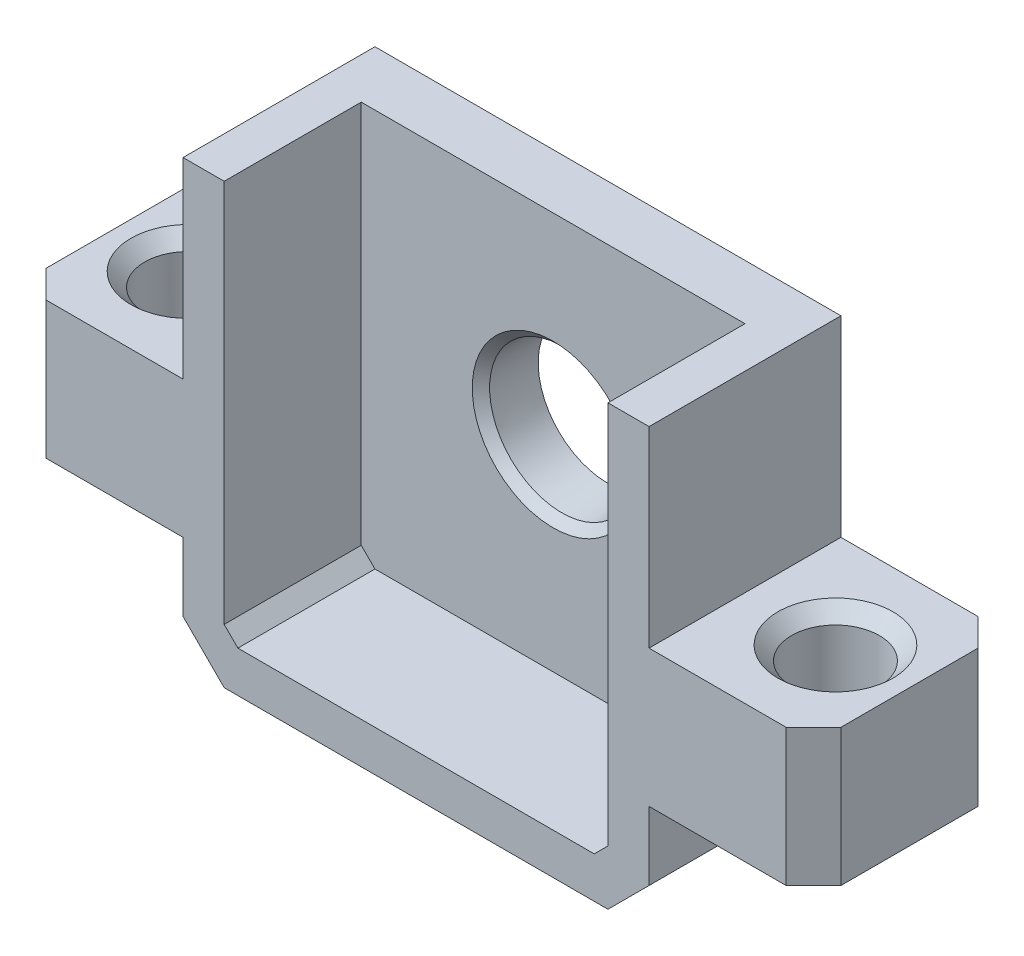
ISO-10303-21;
HEADER;
FILE_DESCRIPTION(('STEP AP214'),'2;1');
FILE_NAME('part.step','',(''),(''),'','','');
FILE_SCHEMA(('AUTOMOTIVE_DESIGN { 1 0 10303 214 1 1 1 1 }'));
ENDSEC;
DATA;
#1=APPLICATION_CONTEXT('core data for automotive mechanical design processes');
#2=APPLICATION_PROTOCOL_DEFINITION('international standard','automotive_design',2000,#1);
#3=PRODUCT_CONTEXT('',#1,'mechanical');
#4=PRODUCT('Part','Part','',(#3));
#5=PRODUCT_RELATED_PRODUCT_CATEGORY('part','',(#4));
#6=PRODUCT_DEFINITION_FORMATION('','',#4);
#7=PRODUCT_DEFINITION_CONTEXT('part definition',#1,'design');
#8=PRODUCT_DEFINITION('design','',#6,#7);
#9=PRODUCT_DEFINITION_SHAPE('','',#8);
#10=(LENGTH_UNIT() NAMED_UNIT(*) SI_UNIT(.MILLI.,.METRE.));
#11=(NAMED_UNIT(*) PLANE_ANGLE_UNIT() SI_UNIT($,.RADIAN.));
#12=(NAMED_UNIT(*) SI_UNIT($,.STERADIAN.) SOLID_ANGLE_UNIT());
#13=UNCERTAINTY_MEASURE_WITH_UNIT(LENGTH_MEASURE(1.E-05),#10,'distance_accuracy_value','');
#14=(GEOMETRIC_REPRESENTATION_CONTEXT(3) GLOBAL_UNCERTAINTY_ASSIGNED_CONTEXT((#13)) GLOBAL_UNIT_ASSIGNED_CONTEXT((#10,
#11,#12)) REPRESENTATION_CONTEXT('',''));
#15=CARTESIAN_POINT('',(0.,0.,0.));
#16=DIRECTION('',(0.,0.,1.));
#17=DIRECTION('',(1.,0.,0.));
#18=AXIS2_PLACEMENT_3D('',#15,#16,#17);
#19=CARTESIAN_POINT('',(-8.5,9.,2.));
#20=DIRECTION('',(1.,0.,0.));
#21=DIRECTION('',(0.,0.,-1.));
#22=AXIS2_PLACEMENT_3D('',#19,#20,#21);
#23=PLANE('',#22);
#24=DIRECTION('',(0.,0.,1.));
#25=VECTOR('',#24,1.);
#26=CARTESIAN_POINT('',(-8.5,7.,2.));
#27=LINE('',#26,#25);
#28=CARTESIAN_POINT('',(-8.5,7.,0.));
#29=VERTEX_POINT('',#28);
#30=CARTESIAN_POINT('',(-8.5,7.,7.));
#31=VERTEX_POINT('',#30);
#32=EDGE_CURVE('E501',#29,#31,#27,.T.);
#33=ORIENTED_EDGE('',*,*,#32,.F.);
#34=DIRECTION('',(0.,-1.,0.));
#35=VECTOR('',#34,1.);
#36=CARTESIAN_POINT('',(-8.5,9.,0.));
#37=LINE('',#36,#35);
#38=CARTESIAN_POINT('',(-8.5,0.,0.));
#39=VERTEX_POINT('',#38);
#40=EDGE_CURVE('E241',#29,#39,#37,.T.);
#41=ORIENTED_EDGE('',*,*,#40,.T.);
#42=DIRECTION('',(0.,0.,-1.));
#43=VECTOR('',#42,1.);
#44=CARTESIAN_POINT('',(-8.5,0.,0.));
#45=LINE('',#44,#43);
#46=CARTESIAN_POINT('',(-8.5,0.,7.));
#47=VERTEX_POINT('',#46);
#48=EDGE_CURVE('E434',#47,#39,#45,.T.);
#49=ORIENTED_EDGE('',*,*,#48,.F.);
#50=DIRECTION('',(0.,-1.,0.));
#51=VECTOR('',#50,1.);
#52=CARTESIAN_POINT('',(-8.5,9.,7.));
#53=LINE('',#52,#51);
#54=EDGE_CURVE('E231',#31,#47,#53,.T.);
#55=ORIENTED_EDGE('',*,*,#54,.F.);
#56=EDGE_LOOP('',(#33,#41,#49,#55));
#57=FACE_BOUND('',#56,.T.);
#58=ADVANCED_FACE('F35',(#57),#23,.F.);
#59=CARTESIAN_POINT('',(8.5,9.,2.));
#60=DIRECTION('',(-1.,0.,0.));
#61=DIRECTION('',(0.,0.,1.));
#62=AXIS2_PLACEMENT_3D('',#59,#60,#61);
#63=PLANE('',#62);
#64=DIRECTION('',(0.,0.,-1.));
#65=VECTOR('',#64,1.);
#66=CARTESIAN_POINT('',(8.5,7.,2.));
#67=LINE('',#66,#65);
#68=CARTESIAN_POINT('',(8.5,7.,7.));
#69=VERTEX_POINT('',#68);
#70=CARTESIAN_POINT('',(8.5,7.,0.));
#71=VERTEX_POINT('',#70);
#72=EDGE_CURVE('E525',#69,#71,#67,.T.);
#73=ORIENTED_EDGE('',*,*,#72,.F.);
#74=DIRECTION('',(0.,1.,0.));
#75=VECTOR('',#74,1.);
#76=CARTESIAN_POINT('',(8.5,9.,7.));
#77=LINE('',#76,#75);
#78=CARTESIAN_POINT('',(8.5,0.,7.));
#79=VERTEX_POINT('',#78);
#80=EDGE_CURVE('E237',#79,#69,#77,.T.);
#81=ORIENTED_EDGE('',*,*,#80,.F.);
#82=DIRECTION('',(0.,0.,-1.));
#83=VECTOR('',#82,1.);
#84=CARTESIAN_POINT('',(8.5,0.,0.));
#85=LINE('',#84,#83);
#86=CARTESIAN_POINT('',(8.5,0.,0.));
#87=VERTEX_POINT('',#86);
#88=EDGE_CURVE('E271',#79,#87,#85,.T.);
#89=ORIENTED_EDGE('',*,*,#88,.T.);
#90=DIRECTION('',(0.,1.,0.));
#91=VECTOR('',#90,1.);
#92=CARTESIAN_POINT('',(8.5,9.,0.));
#93=LINE('',#92,#91);
#94=EDGE_CURVE('E246',#87,#71,#93,.T.);
#95=ORIENTED_EDGE('',*,*,#94,.T.);
#96=EDGE_LOOP('',(#73,#81,#89,#95));
#97=FACE_BOUND('',#96,.T.);
#98=ADVANCED_FACE('F354',(#97),#63,.F.);
#99=CARTESIAN_POINT('',(0.,0.,0.));
#100=DIRECTION('',(0.,0.,1.));
#101=DIRECTION('',(1.,0.,0.));
#102=AXIS2_PLACEMENT_3D('',#99,#100,#101);
#103=PLANE('',#102);
#104=CARTESIAN_POINT('',(0.,0.,0.));
#105=DIRECTION('',(0.,0.,1.));
#106=DIRECTION('',(1.,0.,0.));
#107=AXIS2_PLACEMENT_3D('',#104,#105,#106);
#108=CIRCLE('',#107,2.54518444143392);
#109=CARTESIAN_POINT('',(2.54518444143392,0.,0.));
#110=VERTEX_POINT('',#109);
#111=EDGE_CURVE('E272',#110,#110,#108,.T.);
#112=ORIENTED_EDGE('',*,*,#111,.T.);
#113=EDGE_LOOP('',(#112));
#114=FACE_BOUND('',#113,.T.);
#115=DIRECTION('',(-1.,0.,0.));
#116=VECTOR('',#115,1.);
#117=CARTESIAN_POINT('',(0.,7.,0.));
#118=LINE('',#117,#116);
#119=EDGE_CURVE('E527',#71,#29,#118,.T.);
#120=ORIENTED_EDGE('',*,*,#119,.F.);
#121=ORIENTED_EDGE('',*,*,#94,.F.);
#122=DIRECTION('',(-1.,0.,0.));
#123=VECTOR('',#122,1.);
#124=CARTESIAN_POINT('',(14.5,0.,0.));
#125=LINE('',#124,#123);
#126=CARTESIAN_POINT('',(13.5,0.,0.));
#127=VERTEX_POINT('',#126);
#128=EDGE_CURVE('E425',#127,#87,#125,.T.);
#129=ORIENTED_EDGE('',*,*,#128,.F.);
#130=DIRECTION('',(0.,-1.,0.));
#131=VECTOR('',#130,1.);
#132=CARTESIAN_POINT('',(13.5,-5.,0.));
#133=LINE('',#132,#131);
#134=CARTESIAN_POINT('',(13.5,-5.,0.));
#135=VERTEX_POINT('',#134);
#136=EDGE_CURVE('E267',#127,#135,#133,.T.);
#137=ORIENTED_EDGE('',*,*,#136,.T.);
#138=DIRECTION('',(-1.,0.,0.));
#139=VECTOR('',#138,1.);
#140=CARTESIAN_POINT('',(14.5,-5.,0.));
#141=LINE('',#140,#139);
#142=CARTESIAN_POINT('',(8.5,-5.,0.));
#143=VERTEX_POINT('',#142);
#144=EDGE_CURVE('E419',#135,#143,#141,.T.);
#145=ORIENTED_EDGE('',*,*,#144,.T.);
#146=CARTESIAN_POINT('',(8.5,-7.5,0.));
#147=VERTEX_POINT('',#146);
#148=EDGE_CURVE('E247',#147,#143,#93,.T.);
#149=ORIENTED_EDGE('',*,*,#148,.F.);
#150=DIRECTION('',(0.707106781186549,0.707106781186546,0.));
#151=VECTOR('',#150,1.);
#152=CARTESIAN_POINT('',(8.5,-7.5,0.));
#153=LINE('',#152,#151);
#154=CARTESIAN_POINT('',(6.99999999999999,-9.,0.));
#155=VERTEX_POINT('',#154);
#156=EDGE_CURVE('E292',#147,#155,#153,.F.);
#157=ORIENTED_EDGE('',*,*,#156,.T.);
#158=DIRECTION('',(1.,0.,0.));
#159=VECTOR('',#158,1.);
#160=CARTESIAN_POINT('',(-8.5,-9.,0.));
#161=LINE('',#160,#159);
#162=CARTESIAN_POINT('',(-7.00000000000001,-9.,0.));
#163=VERTEX_POINT('',#162);
#164=EDGE_CURVE('E243',#163,#155,#161,.T.);
#165=ORIENTED_EDGE('',*,*,#164,.F.);
#166=DIRECTION('',(0.707106781186545,-0.70710678118655,0.));
#167=VECTOR('',#166,1.);
#168=CARTESIAN_POINT('',(-7.00000000000001,-9.,0.));
#169=LINE('',#168,#167);
#170=CARTESIAN_POINT('',(-8.5,-7.49999999999999,0.));
#171=VERTEX_POINT('',#170);
#172=EDGE_CURVE('E290',#163,#171,#169,.F.);
#173=ORIENTED_EDGE('',*,*,#172,.T.);
#174=CARTESIAN_POINT('',(-8.5,-5.,0.));
#175=VERTEX_POINT('',#174);
#176=EDGE_CURVE('E240',#175,#171,#37,.T.);
#177=ORIENTED_EDGE('',*,*,#176,.F.);
#178=DIRECTION('',(1.,0.,0.));
#179=VECTOR('',#178,1.);
#180=CARTESIAN_POINT('',(-14.5,-5.,0.));
#181=LINE('',#180,#179);
#182=CARTESIAN_POINT('',(-13.5,-5.,0.));
#183=VERTEX_POINT('',#182);
#184=EDGE_CURVE('E219',#183,#175,#181,.T.);
#185=ORIENTED_EDGE('',*,*,#184,.F.);
#186=DIRECTION('',(0.,1.,0.));
#187=VECTOR('',#186,1.);
#188=CARTESIAN_POINT('',(-13.5,0.,0.));
#189=LINE('',#188,#187);
#190=CARTESIAN_POINT('',(-13.5,0.,0.));
#191=VERTEX_POINT('',#190);
#192=EDGE_CURVE('E259',#183,#191,#189,.T.);
#193=ORIENTED_EDGE('',*,*,#192,.T.);
#194=DIRECTION('',(1.,0.,0.));
#195=VECTOR('',#194,1.);
#196=CARTESIAN_POINT('',(-14.5,0.,0.));
#197=LINE('',#196,#195);
#198=EDGE_CURVE('E437',#191,#39,#197,.T.);
#199=ORIENTED_EDGE('',*,*,#198,.T.);
#200=ORIENTED_EDGE('',*,*,#40,.F.);
#201=EDGE_LOOP('',(#120,#121,#129,#137,#145,#149,#157,#165,#173,#177,#185,#193,#199,#200));
#202=FACE_BOUND('',#201,.T.);
#203=ADVANCED_FACE('F361',(#114,#202),#103,.F.);
#204=CARTESIAN_POINT('',(0.,0.,7.));
#205=DIRECTION('',(0.,0.,1.));
#206=DIRECTION('',(1.,0.,0.));
#207=AXIS2_PLACEMENT_3D('',#204,#205,#206);
#208=PLANE('',#207);
#209=ORIENTED_EDGE('',*,*,#80,.T.);
#210=DIRECTION('',(-1.,0.,0.));
#211=VECTOR('',#210,1.);
#212=CARTESIAN_POINT('',(0.,7.,7.));
#213=LINE('',#212,#211);
#214=CARTESIAN_POINT('',(7.,7.,7.));
#215=VERTEX_POINT('',#214);
#216=EDGE_CURVE('E213',#69,#215,#213,.T.);
#217=ORIENTED_EDGE('',*,*,#216,.T.);
#218=DIRECTION('',(0.,1.,0.));
#219=VECTOR('',#218,1.);
#220=CARTESIAN_POINT('',(7.,7.5,7.));
#221=LINE('',#220,#219);
#222=CARTESIAN_POINT('',(7.,-7.,7.));
#223=VERTEX_POINT('',#222);
#224=EDGE_CURVE('E226',#223,#215,#221,.T.);
#225=ORIENTED_EDGE('',*,*,#224,.F.);
#226=DIRECTION('',(0.707106781186553,0.707106781186542,0.));
#227=VECTOR('',#226,1.);
#228=CARTESIAN_POINT('',(6.49999999999999,-7.5,7.));
#229=LINE('',#228,#227);
#230=CARTESIAN_POINT('',(6.49999999999999,-7.5,7.));
#231=VERTEX_POINT('',#230);
#232=EDGE_CURVE('E203',#223,#231,#229,.F.);
#233=ORIENTED_EDGE('',*,*,#232,.T.);
#234=DIRECTION('',(1.,0.,0.));
#235=VECTOR('',#234,1.);
#236=CARTESIAN_POINT('',(-7.,-7.5,7.));
#237=LINE('',#236,#235);
#238=CARTESIAN_POINT('',(-6.49999999999999,-7.5,7.));
#239=VERTEX_POINT('',#238);
#240=EDGE_CURVE('E447',#239,#231,#237,.T.);
#241=ORIENTED_EDGE('',*,*,#240,.F.);
#242=DIRECTION('',(0.707106781186543,-0.707106781186552,0.));
#243=VECTOR('',#242,1.);
#244=CARTESIAN_POINT('',(-7.,-6.99999999999999,7.));
#245=LINE('',#244,#243);
#246=CARTESIAN_POINT('',(-7.,-6.99999999999999,7.));
#247=VERTEX_POINT('',#246);
#248=EDGE_CURVE('E51',#239,#247,#245,.F.);
#249=ORIENTED_EDGE('',*,*,#248,.T.);
#250=DIRECTION('',(0.,-1.,0.));
#251=VECTOR('',#250,1.);
#252=CARTESIAN_POINT('',(-7.,7.5,7.));
#253=LINE('',#252,#251);
#254=CARTESIAN_POINT('',(-7.,7.,7.));
#255=VERTEX_POINT('',#254);
#256=EDGE_CURVE('E230',#255,#247,#253,.T.);
#257=ORIENTED_EDGE('',*,*,#256,.F.);
#258=EDGE_CURVE('E59',#255,#31,#213,.T.);
#259=ORIENTED_EDGE('',*,*,#258,.T.);
#260=ORIENTED_EDGE('',*,*,#54,.T.);
#261=DIRECTION('',(1.,0.,0.));
#262=VECTOR('',#261,1.);
#263=CARTESIAN_POINT('',(-14.5,0.,7.));
#264=LINE('',#263,#262);
#265=CARTESIAN_POINT('',(-13.5,0.,7.));
#266=VERTEX_POINT('',#265);
#267=EDGE_CURVE('E443',#266,#47,#264,.T.);
#268=ORIENTED_EDGE('',*,*,#267,.F.);
#269=DIRECTION('',(0.,-1.,0.));
#270=VECTOR('',#269,1.);
#271=CARTESIAN_POINT('',(-13.5,0.,7.));
#272=LINE('',#271,#270);
#273=CARTESIAN_POINT('',(-13.5,-5.,7.));
#274=VERTEX_POINT('',#273);
#275=EDGE_CURVE('E265',#266,#274,#272,.T.);
#276=ORIENTED_EDGE('',*,*,#275,.T.);
#277=DIRECTION('',(1.,0.,0.));
#278=VECTOR('',#277,1.);
#279=CARTESIAN_POINT('',(-14.5,-5.,7.));
#280=LINE('',#279,#278);
#281=CARTESIAN_POINT('',(-8.5,-5.,7.));
#282=VERTEX_POINT('',#281);
#283=EDGE_CURVE('E223',#274,#282,#280,.T.);
#284=ORIENTED_EDGE('',*,*,#283,.T.);
#285=CARTESIAN_POINT('',(-8.5,-7.49999999999999,7.));
#286=VERTEX_POINT('',#285);
#287=EDGE_CURVE('E234',#282,#286,#53,.T.);
#288=ORIENTED_EDGE('',*,*,#287,.T.);
#289=DIRECTION('',(-0.707106781186545,0.70710678118655,0.));
#290=VECTOR('',#289,1.);
#291=CARTESIAN_POINT('',(-8.00000000000003,-7.99999999999997,7.));
#292=LINE('',#291,#290);
#293=CARTESIAN_POINT('',(-7.00000000000001,-9.,7.));
#294=VERTEX_POINT('',#293);
#295=EDGE_CURVE('E294',#286,#294,#292,.F.);
#296=ORIENTED_EDGE('',*,*,#295,.T.);
#297=DIRECTION('',(1.,0.,0.));
#298=VECTOR('',#297,1.);
#299=CARTESIAN_POINT('',(-8.5,-9.,7.));
#300=LINE('',#299,#298);
#301=CARTESIAN_POINT('',(6.99999999999999,-9.,7.));
#302=VERTEX_POINT('',#301);
#303=EDGE_CURVE('E233',#294,#302,#300,.T.);
#304=ORIENTED_EDGE('',*,*,#303,.T.);
#305=DIRECTION('',(-0.707106781186549,-0.707106781186546,0.));
#306=VECTOR('',#305,1.);
#307=CARTESIAN_POINT('',(7.99999999999998,-8.00000000000001,7.));
#308=LINE('',#307,#306);
#309=CARTESIAN_POINT('',(8.5,-7.5,7.));
#310=VERTEX_POINT('',#309);
#311=EDGE_CURVE('E296',#302,#310,#308,.F.);
#312=ORIENTED_EDGE('',*,*,#311,.T.);
#313=CARTESIAN_POINT('',(8.5,-5.,7.));
#314=VERTEX_POINT('',#313);
#315=EDGE_CURVE('E238',#310,#314,#77,.T.);
#316=ORIENTED_EDGE('',*,*,#315,.T.);
#317=DIRECTION('',(-1.,0.,0.));
#318=VECTOR('',#317,1.);
#319=CARTESIAN_POINT('',(14.5,-5.,7.));
#320=LINE('',#319,#318);
#321=CARTESIAN_POINT('',(13.5,-5.,7.));
#322=VERTEX_POINT('',#321);
#323=EDGE_CURVE('E421',#322,#314,#320,.T.);
#324=ORIENTED_EDGE('',*,*,#323,.F.);
#325=DIRECTION('',(0.,1.,0.));
#326=VECTOR('',#325,1.);
#327=CARTESIAN_POINT('',(13.5,0.,7.));
#328=LINE('',#327,#326);
#329=CARTESIAN_POINT('',(13.5,0.,7.));
#330=VERTEX_POINT('',#329);
#331=EDGE_CURVE('E287',#322,#330,#328,.T.);
#332=ORIENTED_EDGE('',*,*,#331,.T.);
#333=DIRECTION('',(-1.,0.,0.));
#334=VECTOR('',#333,1.);
#335=CARTESIAN_POINT('',(14.5,0.,7.));
#336=LINE('',#335,#334);
#337=EDGE_CURVE('E423',#330,#79,#336,.T.);
#338=ORIENTED_EDGE('',*,*,#337,.T.);
#339=EDGE_LOOP('',(#209,#217,#225,#233,#241,#249,#257,#259,#260,#268,#276,#284,#288,#296,#304,
#312,#316,#324,#332,#338));
#340=FACE_BOUND('',#339,.T.);
#341=ADVANCED_FACE('F393',(#340),#208,.T.);
#342=CARTESIAN_POINT('',(0.,0.,2.));
#343=DIRECTION('',(0.,0.,1.));
#344=DIRECTION('',(1.,0.,0.));
#345=AXIS2_PLACEMENT_3D('',#342,#343,#344);
#346=PLANE('',#345);
#347=CARTESIAN_POINT('',(0.,0.,2.));
#348=DIRECTION('',(0.,0.,1.));
#349=DIRECTION('',(1.,0.,0.));
#350=AXIS2_PLACEMENT_3D('',#347,#348,#349);
#351=CIRCLE('',#350,2.95);
#352=CARTESIAN_POINT('',(2.95,0.,2.));
#353=VERTEX_POINT('',#352);
#354=EDGE_CURVE('E327',#353,#353,#351,.F.);
#355=ORIENTED_EDGE('',*,*,#354,.T.);
#356=EDGE_LOOP('',(#355));
#357=FACE_BOUND('',#356,.T.);
#358=DIRECTION('',(0.,1.,0.));
#359=VECTOR('',#358,1.);
#360=CARTESIAN_POINT('',(7.,7.5,2.));
#361=LINE('',#360,#359);
#362=CARTESIAN_POINT('',(7.,-7.,2.));
#363=VERTEX_POINT('',#362);
#364=CARTESIAN_POINT('',(7.,7.,2.));
#365=VERTEX_POINT('',#364);
#366=EDGE_CURVE('E212',#363,#365,#361,.T.);
#367=ORIENTED_EDGE('',*,*,#366,.T.);
#368=DIRECTION('',(-1.,0.,0.));
#369=VECTOR('',#368,1.);
#370=CARTESIAN_POINT('',(0.,7.,2.));
#371=LINE('',#370,#369);
#372=CARTESIAN_POINT('',(-7.,7.,2.));
#373=VERTEX_POINT('',#372);
#374=EDGE_CURVE('E199',#365,#373,#371,.T.);
#375=ORIENTED_EDGE('',*,*,#374,.T.);
#376=DIRECTION('',(0.,-1.,0.));
#377=VECTOR('',#376,1.);
#378=CARTESIAN_POINT('',(-7.,7.5,2.));
#379=LINE('',#378,#377);
#380=CARTESIAN_POINT('',(-7.,-6.99999999999999,2.));
#381=VERTEX_POINT('',#380);
#382=EDGE_CURVE('E210',#373,#381,#379,.T.);
#383=ORIENTED_EDGE('',*,*,#382,.T.);
#384=DIRECTION('',(-0.707106781186543,0.707106781186552,0.));
#385=VECTOR('',#384,1.);
#386=CARTESIAN_POINT('',(-7.00000000000004,-6.99999999999994,2.));
#387=LINE('',#386,#385);
#388=CARTESIAN_POINT('',(-6.49999999999999,-7.5,2.));
#389=VERTEX_POINT('',#388);
#390=EDGE_CURVE('E313',#381,#389,#387,.F.);
#391=ORIENTED_EDGE('',*,*,#390,.T.);
#392=DIRECTION('',(1.,0.,0.));
#393=VECTOR('',#392,1.);
#394=CARTESIAN_POINT('',(-7.,-7.5,2.));
#395=LINE('',#394,#393);
#396=CARTESIAN_POINT('',(6.49999999999999,-7.5,2.));
#397=VERTEX_POINT('',#396);
#398=EDGE_CURVE('E218',#389,#397,#395,.T.);
#399=ORIENTED_EDGE('',*,*,#398,.T.);
#400=DIRECTION('',(-0.707106781186553,-0.707106781186542,0.));
#401=VECTOR('',#400,1.);
#402=CARTESIAN_POINT('',(6.99999999999995,-7.00000000000006,2.));
#403=LINE('',#402,#401);
#404=EDGE_CURVE('E315',#397,#363,#403,.F.);
#405=ORIENTED_EDGE('',*,*,#404,.T.);
#406=EDGE_LOOP('',(#367,#375,#383,#391,#399,#405));
#407=FACE_BOUND('',#406,.T.);
#408=ADVANCED_FACE('F209',(#357,#407),#346,.T.);
#409=ORIENTED_EDGE('',*,*,#315,.F.);
#410=DIRECTION('',(0.,0.,-1.));
#411=VECTOR('',#410,1.);
#412=CARTESIAN_POINT('',(8.5,-7.5,2.));
#413=LINE('',#412,#411);
#414=EDGE_CURVE('E298',#310,#147,#413,.T.);
#415=ORIENTED_EDGE('',*,*,#414,.T.);
#416=ORIENTED_EDGE('',*,*,#148,.T.);
#417=DIRECTION('',(0.,0.,1.));
#418=VECTOR('',#417,1.);
#419=CARTESIAN_POINT('',(8.5,-5.,0.));
#420=LINE('',#419,#418);
#421=EDGE_CURVE('E406',#143,#314,#420,.T.);
#422=ORIENTED_EDGE('',*,*,#421,.T.);
#423=EDGE_LOOP('',(#409,#415,#416,#422));
#424=FACE_BOUND('',#423,.T.);
#425=ADVANCED_FACE('F364',(#424),#63,.F.);
#426=ORIENTED_EDGE('',*,*,#176,.T.);
#427=DIRECTION('',(0.,0.,1.));
#428=VECTOR('',#427,1.);
#429=CARTESIAN_POINT('',(-8.5,-7.49999999999999,2.));
#430=LINE('',#429,#428);
#431=EDGE_CURVE('E306',#171,#286,#430,.T.);
#432=ORIENTED_EDGE('',*,*,#431,.T.);
#433=ORIENTED_EDGE('',*,*,#287,.F.);
#434=DIRECTION('',(0.,0.,1.));
#435=VECTOR('',#434,1.);
#436=CARTESIAN_POINT('',(-8.5,-5.,0.));
#437=LINE('',#436,#435);
#438=EDGE_CURVE('E384',#175,#282,#437,.T.);
#439=ORIENTED_EDGE('',*,*,#438,.F.);
#440=EDGE_LOOP('',(#426,#432,#433,#439));
#441=FACE_BOUND('',#440,.T.);
#442=ADVANCED_FACE('F357',(#441),#23,.F.);
#443=CARTESIAN_POINT('',(-8.5,-9.,2.));
#444=DIRECTION('',(0.,1.,0.));
#445=DIRECTION('',(0.,0.,1.));
#446=AXIS2_PLACEMENT_3D('',#443,#444,#445);
#447=PLANE('',#446);
#448=ORIENTED_EDGE('',*,*,#164,.T.);
#449=DIRECTION('',(0.,0.,1.));
#450=VECTOR('',#449,1.);
#451=CARTESIAN_POINT('',(6.99999999999999,-9.,2.));
#452=LINE('',#451,#450);
#453=EDGE_CURVE('E304',#155,#302,#452,.T.);
#454=ORIENTED_EDGE('',*,*,#453,.T.);
#455=ORIENTED_EDGE('',*,*,#303,.F.);
#456=DIRECTION('',(0.,0.,-1.));
#457=VECTOR('',#456,1.);
#458=CARTESIAN_POINT('',(-7.00000000000001,-9.,2.));
#459=LINE('',#458,#457);
#460=EDGE_CURVE('E301',#294,#163,#459,.T.);
#461=ORIENTED_EDGE('',*,*,#460,.T.);
#462=EDGE_LOOP('',(#448,#454,#455,#461));
#463=FACE_BOUND('',#462,.T.);
#464=ADVANCED_FACE('F369',(#463),#447,.F.);
#465=CARTESIAN_POINT('',(-7.,7.5,7.));
#466=DIRECTION('',(1.,0.,0.));
#467=DIRECTION('',(0.,1.,0.));
#468=AXIS2_PLACEMENT_3D('',#465,#466,#467);
#469=PLANE('',#468);
#470=ORIENTED_EDGE('',*,*,#382,.F.);
#471=DIRECTION('',(0.,0.,1.));
#472=VECTOR('',#471,1.);
#473=CARTESIAN_POINT('',(-7.,7.,7.));
#474=LINE('',#473,#472);
#475=EDGE_CURVE('E196',#373,#255,#474,.T.);
#476=ORIENTED_EDGE('',*,*,#475,.T.);
#477=ORIENTED_EDGE('',*,*,#256,.T.);
#478=DIRECTION('',(0.,0.,-1.));
#479=VECTOR('',#478,1.);
#480=CARTESIAN_POINT('',(-7.,-6.99999999999999,2.));
#481=LINE('',#480,#479);
#482=EDGE_CURVE('E204',#247,#381,#481,.T.);
#483=ORIENTED_EDGE('',*,*,#482,.T.);
#484=EDGE_LOOP('',(#470,#476,#477,#483));
#485=FACE_BOUND('',#484,.T.);
#486=ADVANCED_FACE('F216',(#485),#469,.T.);
#487=CARTESIAN_POINT('',(-7.,-7.5,7.));
#488=DIRECTION('',(0.,1.,0.));
#489=DIRECTION('',(0.,0.,1.));
#490=AXIS2_PLACEMENT_3D('',#487,#488,#489);
#491=PLANE('',#490);
#492=ORIENTED_EDGE('',*,*,#240,.T.);
#493=DIRECTION('',(0.,0.,-1.));
#494=VECTOR('',#493,1.);
#495=CARTESIAN_POINT('',(6.49999999999999,-7.5,2.));
#496=LINE('',#495,#494);
#497=EDGE_CURVE('E310',#231,#397,#496,.T.);
#498=ORIENTED_EDGE('',*,*,#497,.T.);
#499=ORIENTED_EDGE('',*,*,#398,.F.);
#500=DIRECTION('',(0.,0.,1.));
#501=VECTOR('',#500,1.);
#502=CARTESIAN_POINT('',(-6.49999999999999,-7.5,7.));
#503=LINE('',#502,#501);
#504=EDGE_CURVE('E308',#389,#239,#503,.T.);
#505=ORIENTED_EDGE('',*,*,#504,.T.);
#506=EDGE_LOOP('',(#492,#498,#499,#505));
#507=FACE_BOUND('',#506,.T.);
#508=ADVANCED_FACE('F461',(#507),#491,.T.);
#509=CARTESIAN_POINT('',(7.,7.5,7.));
#510=DIRECTION('',(-1.,0.,0.));
#511=DIRECTION('',(0.,-1.,0.));
#512=AXIS2_PLACEMENT_3D('',#509,#510,#511);
#513=PLANE('',#512);
#514=ORIENTED_EDGE('',*,*,#366,.F.);
#515=DIRECTION('',(0.,0.,1.));
#516=VECTOR('',#515,1.);
#517=CARTESIAN_POINT('',(7.,-7.,7.));
#518=LINE('',#517,#516);
#519=EDGE_CURVE('E319',#363,#223,#518,.T.);
#520=ORIENTED_EDGE('',*,*,#519,.T.);
#521=ORIENTED_EDGE('',*,*,#224,.T.);
#522=DIRECTION('',(0.,0.,-1.));
#523=VECTOR('',#522,1.);
#524=CARTESIAN_POINT('',(7.,6.99999999999999,2.));
#525=LINE('',#524,#523);
#526=EDGE_CURVE('E317',#215,#365,#525,.T.);
#527=ORIENTED_EDGE('',*,*,#526,.T.);
#528=EDGE_LOOP('',(#514,#520,#521,#527));
#529=FACE_BOUND('',#528,.T.);
#530=ADVANCED_FACE('F454',(#529),#513,.T.);
#531=CARTESIAN_POINT('',(-14.5,-5.,0.));
#532=DIRECTION('',(0.,1.,0.));
#533=DIRECTION('',(0.,0.,1.));
#534=AXIS2_PLACEMENT_3D('',#531,#532,#533);
#535=PLANE('',#534);
#536=CARTESIAN_POINT('',(-11.8,-5.,3.5));
#537=DIRECTION('',(0.,1.,0.));
#538=DIRECTION('',(0.,0.,1.));
#539=AXIS2_PLACEMENT_3D('',#536,#537,#538);
#540=CIRCLE('',#539,1.6);
#541=CARTESIAN_POINT('',(-11.8,-5.,5.1));
#542=VERTEX_POINT('',#541);
#543=EDGE_CURVE('E427',#542,#542,#540,.T.);
#544=ORIENTED_EDGE('',*,*,#543,.T.);
#545=EDGE_LOOP('',(#544));
#546=FACE_BOUND('',#545,.T.);
#547=DIRECTION('',(0.,0.,1.));
#548=VECTOR('',#547,1.);
#549=CARTESIAN_POINT('',(-14.5,-5.,0.));
#550=LINE('',#549,#548);
#551=CARTESIAN_POINT('',(-14.5,-5.,0.999999999999997));
#552=VERTEX_POINT('',#551);
#553=CARTESIAN_POINT('',(-14.5,-5.,6.));
#554=VERTEX_POINT('',#553);
#555=EDGE_CURVE('E430',#552,#554,#550,.T.);
#556=ORIENTED_EDGE('',*,*,#555,.F.);
#557=DIRECTION('',(0.707106781186549,0.,-0.707106781186546));
#558=VECTOR('',#557,1.);
#559=CARTESIAN_POINT('',(-14.5,-5.,0.999999999999997));
#560=LINE('',#559,#558);
#561=EDGE_CURVE('E257',#552,#183,#560,.T.);
#562=ORIENTED_EDGE('',*,*,#561,.T.);
#563=ORIENTED_EDGE('',*,*,#184,.T.);
#564=ORIENTED_EDGE('',*,*,#438,.T.);
#565=ORIENTED_EDGE('',*,*,#283,.F.);
#566=DIRECTION('',(0.707106781186549,0.,0.707106781186546));
#567=VECTOR('',#566,1.);
#568=CARTESIAN_POINT('',(-14.5,-5.,6.));
#569=LINE('',#568,#567);
#570=EDGE_CURVE('E255',#274,#554,#569,.F.);
#571=ORIENTED_EDGE('',*,*,#570,.T.);
#572=EDGE_LOOP('',(#556,#562,#563,#564,#565,#571));
#573=FACE_BOUND('',#572,.T.);
#574=ADVANCED_FACE('F546',(#546,#573),#535,.F.);
#575=CARTESIAN_POINT('',(-14.5,0.,0.));
#576=DIRECTION('',(0.,-1.,0.));
#577=DIRECTION('',(0.,0.,-1.));
#578=AXIS2_PLACEMENT_3D('',#575,#576,#577);
#579=PLANE('',#578);
#580=CARTESIAN_POINT('',(-11.8,0.,3.5));
#581=DIRECTION('',(0.,-1.,0.));
#582=DIRECTION('',(0.,0.,-1.));
#583=AXIS2_PLACEMENT_3D('',#580,#581,#582);
#584=CIRCLE('',#583,2.10000000000001);
#585=CARTESIAN_POINT('',(-11.8,0.,1.39999999999999));
#586=VERTEX_POINT('',#585);
#587=EDGE_CURVE('E11',#586,#586,#584,.T.);
#588=ORIENTED_EDGE('',*,*,#587,.T.);
#589=EDGE_LOOP('',(#588));
#590=FACE_BOUND('',#589,.T.);
#591=ORIENTED_EDGE('',*,*,#198,.F.);
#592=DIRECTION('',(-0.707106781186549,0.,0.707106781186546));
#593=VECTOR('',#592,1.);
#594=CARTESIAN_POINT('',(-14.5,0.,0.999999999999997));
#595=LINE('',#594,#593);
#596=CARTESIAN_POINT('',(-14.5,0.,0.999999999999997));
#597=VERTEX_POINT('',#596);
#598=EDGE_CURVE('E263',#191,#597,#595,.T.);
#599=ORIENTED_EDGE('',*,*,#598,.T.);
#600=DIRECTION('',(0.,0.,-1.));
#601=VECTOR('',#600,1.);
#602=CARTESIAN_POINT('',(-14.5,0.,0.));
#603=LINE('',#602,#601);
#604=CARTESIAN_POINT('',(-14.5,0.,6.));
#605=VERTEX_POINT('',#604);
#606=EDGE_CURVE('E433',#605,#597,#603,.T.);
#607=ORIENTED_EDGE('',*,*,#606,.F.);
#608=DIRECTION('',(-0.707106781186549,0.,-0.707106781186546));
#609=VECTOR('',#608,1.);
#610=CARTESIAN_POINT('',(-14.5,0.,6.));
#611=LINE('',#610,#609);
#612=EDGE_CURVE('E261',#605,#266,#611,.F.);
#613=ORIENTED_EDGE('',*,*,#612,.T.);
#614=ORIENTED_EDGE('',*,*,#267,.T.);
#615=ORIENTED_EDGE('',*,*,#48,.T.);
#616=EDGE_LOOP('',(#591,#599,#607,#613,#614,#615));
#617=FACE_BOUND('',#616,.T.);
#618=ADVANCED_FACE('F535',(#590,#617),#579,.F.);
#619=CARTESIAN_POINT('',(-14.5,0.,0.));
#620=DIRECTION('',(-1.,0.,0.));
#621=DIRECTION('',(0.,0.,1.));
#622=AXIS2_PLACEMENT_3D('',#619,#620,#621);
#623=PLANE('',#622);
#624=ORIENTED_EDGE('',*,*,#606,.T.);
#625=DIRECTION('',(0.,-1.,0.));
#626=VECTOR('',#625,1.);
#627=CARTESIAN_POINT('',(-14.5,-5.,0.999999999999997));
#628=LINE('',#627,#626);
#629=EDGE_CURVE('E252',#597,#552,#628,.T.);
#630=ORIENTED_EDGE('',*,*,#629,.T.);
#631=ORIENTED_EDGE('',*,*,#555,.T.);
#632=DIRECTION('',(0.,1.,0.));
#633=VECTOR('',#632,1.);
#634=CARTESIAN_POINT('',(-14.5,0.,6.));
#635=LINE('',#634,#633);
#636=EDGE_CURVE('E249',#554,#605,#635,.T.);
#637=ORIENTED_EDGE('',*,*,#636,.T.);
#638=EDGE_LOOP('',(#624,#630,#631,#637));
#639=FACE_BOUND('',#638,.T.);
#640=ADVANCED_FACE('F548',(#639),#623,.T.);
#641=CARTESIAN_POINT('',(-11.8,-9.,3.5));
#642=DIRECTION('',(0.,1.,0.));
#643=DIRECTION('',(0.,0.,1.));
#644=AXIS2_PLACEMENT_3D('',#641,#642,#643);
#645=CYLINDRICAL_SURFACE('',#644,1.6);
#646=CARTESIAN_POINT('',(-11.8,-0.500000000000007,3.5));
#647=DIRECTION('',(0.,-1.,0.));
#648=DIRECTION('',(0.,0.,-1.));
#649=AXIS2_PLACEMENT_3D('',#646,#647,#648);
#650=CIRCLE('',#649,1.6);
#651=CARTESIAN_POINT('',(-11.8,-0.500000000000007,1.9));
#652=VERTEX_POINT('',#651);
#653=EDGE_CURVE('E44',#652,#652,#650,.F.);
#654=ORIENTED_EDGE('',*,*,#653,.T.);
#655=EDGE_LOOP('',(#654));
#656=FACE_BOUND('',#655,.T.);
#657=ORIENTED_EDGE('',*,*,#543,.F.);
#658=EDGE_LOOP('',(#657));
#659=FACE_BOUND('',#658,.T.);
#660=ADVANCED_FACE('F338',(#656,#659),#645,.F.);
#661=CARTESIAN_POINT('',(-14.5,0.,0.999999999999997));
#662=DIRECTION('',(-0.707106781186546,0.,-0.707106781186549));
#663=DIRECTION('',(0.,1.,0.));
#664=AXIS2_PLACEMENT_3D('',#661,#662,#663);
#665=PLANE('',#664);
#666=ORIENTED_EDGE('',*,*,#598,.F.);
#667=ORIENTED_EDGE('',*,*,#192,.F.);
#668=ORIENTED_EDGE('',*,*,#561,.F.);
#669=ORIENTED_EDGE('',*,*,#629,.F.);
#670=EDGE_LOOP('',(#666,#667,#668,#669));
#671=FACE_BOUND('',#670,.T.);
#672=ADVANCED_FACE('F551',(#671),#665,.T.);
#673=CARTESIAN_POINT('',(-14.5,0.,6.));
#674=DIRECTION('',(0.707106781186546,0.,-0.707106781186549));
#675=DIRECTION('',(0.,1.,0.));
#676=AXIS2_PLACEMENT_3D('',#673,#674,#675);
#677=PLANE('',#676);
#678=ORIENTED_EDGE('',*,*,#570,.F.);
#679=ORIENTED_EDGE('',*,*,#275,.F.);
#680=ORIENTED_EDGE('',*,*,#612,.F.);
#681=ORIENTED_EDGE('',*,*,#636,.F.);
#682=EDGE_LOOP('',(#678,#679,#680,#681));
#683=FACE_BOUND('',#682,.T.);
#684=ADVANCED_FACE('F542',(#683),#677,.F.);
#685=CARTESIAN_POINT('',(14.5,0.,0.));
#686=DIRECTION('',(0.,1.,0.));
#687=DIRECTION('',(0.,0.,1.));
#688=AXIS2_PLACEMENT_3D('',#685,#686,#687);
#689=PLANE('',#688);
#690=CARTESIAN_POINT('',(11.8,0.,3.5));
#691=DIRECTION('',(0.,1.,0.));
#692=DIRECTION('',(0.,0.,1.));
#693=AXIS2_PLACEMENT_3D('',#690,#691,#692);
#694=CIRCLE('',#693,2.1);
#695=CARTESIAN_POINT('',(11.8,0.,5.6));
#696=VERTEX_POINT('',#695);
#697=EDGE_CURVE('E330',#696,#696,#694,.F.);
#698=ORIENTED_EDGE('',*,*,#697,.T.);
#699=EDGE_LOOP('',(#698));
#700=FACE_BOUND('',#699,.T.);
#701=DIRECTION('',(0.,0.,-1.));
#702=VECTOR('',#701,1.);
#703=CARTESIAN_POINT('',(14.5,0.,0.));
#704=LINE('',#703,#702);
#705=CARTESIAN_POINT('',(14.5,0.,6.));
#706=VERTEX_POINT('',#705);
#707=CARTESIAN_POINT('',(14.5,0.,1.));
#708=VERTEX_POINT('',#707);
#709=EDGE_CURVE('E410',#706,#708,#704,.T.);
#710=ORIENTED_EDGE('',*,*,#709,.T.);
#711=DIRECTION('',(-0.707106781186549,0.,-0.707106781186546));
#712=VECTOR('',#711,1.);
#713=CARTESIAN_POINT('',(14.,0.,0.500000000000004));
#714=LINE('',#713,#712);
#715=EDGE_CURVE('E285',#708,#127,#714,.T.);
#716=ORIENTED_EDGE('',*,*,#715,.T.);
#717=ORIENTED_EDGE('',*,*,#128,.T.);
#718=ORIENTED_EDGE('',*,*,#88,.F.);
#719=ORIENTED_EDGE('',*,*,#337,.F.);
#720=DIRECTION('',(-0.707106781186549,0.,0.707106781186546));
#721=VECTOR('',#720,1.);
#722=CARTESIAN_POINT('',(17.5,0.,3.00000000000001));
#723=LINE('',#722,#721);
#724=EDGE_CURVE('E283',#330,#706,#723,.F.);
#725=ORIENTED_EDGE('',*,*,#724,.T.);
#726=EDGE_LOOP('',(#710,#716,#717,#718,#719,#725));
#727=FACE_BOUND('',#726,.T.);
#728=ADVANCED_FACE('F518',(#700,#727),#689,.T.);
#729=CARTESIAN_POINT('',(14.5,-5.,0.));
#730=DIRECTION('',(0.,-1.,0.));
#731=DIRECTION('',(0.,0.,-1.));
#732=AXIS2_PLACEMENT_3D('',#729,#730,#731);
#733=PLANE('',#732);
#734=CARTESIAN_POINT('',(11.8,-5.,3.5));
#735=DIRECTION('',(0.,-1.,0.));
#736=DIRECTION('',(0.,0.,-1.));
#737=AXIS2_PLACEMENT_3D('',#734,#735,#736);
#738=CIRCLE('',#737,1.6);
#739=CARTESIAN_POINT('',(11.8,-5.,1.9));
#740=VERTEX_POINT('',#739);
#741=EDGE_CURVE('E268',#740,#740,#738,.F.);
#742=ORIENTED_EDGE('',*,*,#741,.T.);
#743=EDGE_LOOP('',(#742));
#744=FACE_BOUND('',#743,.T.);
#745=ORIENTED_EDGE('',*,*,#144,.F.);
#746=DIRECTION('',(0.707106781186549,0.,0.707106781186546));
#747=VECTOR('',#746,1.);
#748=CARTESIAN_POINT('',(14.,-5.,0.500000000000004));
#749=LINE('',#748,#747);
#750=CARTESIAN_POINT('',(14.5,-5.,1.));
#751=VERTEX_POINT('',#750);
#752=EDGE_CURVE('E277',#135,#751,#749,.T.);
#753=ORIENTED_EDGE('',*,*,#752,.T.);
#754=DIRECTION('',(0.,0.,1.));
#755=VECTOR('',#754,1.);
#756=CARTESIAN_POINT('',(14.5,-5.,0.));
#757=LINE('',#756,#755);
#758=CARTESIAN_POINT('',(14.5,-5.,5.99999999999999));
#759=VERTEX_POINT('',#758);
#760=EDGE_CURVE('E413',#751,#759,#757,.T.);
#761=ORIENTED_EDGE('',*,*,#760,.T.);
#762=DIRECTION('',(0.707106781186549,0.,-0.707106781186546));
#763=VECTOR('',#762,1.);
#764=CARTESIAN_POINT('',(17.5,-5.,3.00000000000001));
#765=LINE('',#764,#763);
#766=EDGE_CURVE('E275',#759,#322,#765,.F.);
#767=ORIENTED_EDGE('',*,*,#766,.T.);
#768=ORIENTED_EDGE('',*,*,#323,.T.);
#769=ORIENTED_EDGE('',*,*,#421,.F.);
#770=EDGE_LOOP('',(#745,#753,#761,#767,#768,#769));
#771=FACE_BOUND('',#770,.T.);
#772=ADVANCED_FACE('F508',(#744,#771),#733,.T.);
#773=CARTESIAN_POINT('',(14.5,0.,0.));
#774=DIRECTION('',(1.,0.,0.));
#775=DIRECTION('',(0.,0.,1.));
#776=AXIS2_PLACEMENT_3D('',#773,#774,#775);
#777=PLANE('',#776);
#778=ORIENTED_EDGE('',*,*,#760,.F.);
#779=DIRECTION('',(0.,1.,0.));
#780=VECTOR('',#779,1.);
#781=CARTESIAN_POINT('',(14.5,0.,1.));
#782=LINE('',#781,#780);
#783=EDGE_CURVE('E281',#751,#708,#782,.T.);
#784=ORIENTED_EDGE('',*,*,#783,.T.);
#785=ORIENTED_EDGE('',*,*,#709,.F.);
#786=DIRECTION('',(0.,-1.,0.));
#787=VECTOR('',#786,1.);
#788=CARTESIAN_POINT('',(14.5,0.,6.));
#789=LINE('',#788,#787);
#790=EDGE_CURVE('E279',#706,#759,#789,.T.);
#791=ORIENTED_EDGE('',*,*,#790,.T.);
#792=EDGE_LOOP('',(#778,#784,#785,#791));
#793=FACE_BOUND('',#792,.T.);
#794=ADVANCED_FACE('F557',(#793),#777,.T.);
#795=CARTESIAN_POINT('',(11.8,-9.,3.5));
#796=DIRECTION('',(0.,1.,0.));
#797=DIRECTION('',(0.,0.,1.));
#798=AXIS2_PLACEMENT_3D('',#795,#796,#797);
#799=CYLINDRICAL_SURFACE('',#798,1.6);
#800=CARTESIAN_POINT('',(11.8,-0.499999999999997,3.5));
#801=DIRECTION('',(0.,1.,0.));
#802=DIRECTION('',(0.,0.,1.));
#803=AXIS2_PLACEMENT_3D('',#800,#801,#802);
#804=CIRCLE('',#803,1.6);
#805=CARTESIAN_POINT('',(11.8,-0.499999999999997,5.1));
#806=VERTEX_POINT('',#805);
#807=EDGE_CURVE('E333',#806,#806,#804,.T.);
#808=ORIENTED_EDGE('',*,*,#807,.T.);
#809=EDGE_LOOP('',(#808));
#810=FACE_BOUND('',#809,.T.);
#811=ORIENTED_EDGE('',*,*,#741,.F.);
#812=EDGE_LOOP('',(#811));
#813=FACE_BOUND('',#812,.T.);
#814=ADVANCED_FACE('F559',(#810,#813),#799,.F.);
#815=CARTESIAN_POINT('',(13.5,0.,0.));
#816=DIRECTION('',(0.707106781186546,0.,-0.707106781186549));
#817=DIRECTION('',(0.,1.,0.));
#818=AXIS2_PLACEMENT_3D('',#815,#816,#817);
#819=PLANE('',#818);
#820=ORIENTED_EDGE('',*,*,#715,.F.);
#821=ORIENTED_EDGE('',*,*,#783,.F.);
#822=ORIENTED_EDGE('',*,*,#752,.F.);
#823=ORIENTED_EDGE('',*,*,#136,.F.);
#824=EDGE_LOOP('',(#820,#821,#822,#823));
#825=FACE_BOUND('',#824,.T.);
#826=ADVANCED_FACE('F556',(#825),#819,.T.);
#827=CARTESIAN_POINT('',(13.5,0.,7.));
#828=DIRECTION('',(-0.707106781186546,0.,-0.707106781186549));
#829=DIRECTION('',(0.,1.,0.));
#830=AXIS2_PLACEMENT_3D('',#827,#828,#829);
#831=PLANE('',#830);
#832=ORIENTED_EDGE('',*,*,#766,.F.);
#833=ORIENTED_EDGE('',*,*,#790,.F.);
#834=ORIENTED_EDGE('',*,*,#724,.F.);
#835=ORIENTED_EDGE('',*,*,#331,.F.);
#836=EDGE_LOOP('',(#832,#833,#834,#835));
#837=FACE_BOUND('',#836,.T.);
#838=ADVANCED_FACE('F514',(#837),#831,.F.);
#839=CARTESIAN_POINT('',(8.5,-7.5,2.));
#840=DIRECTION('',(-0.707106781186546,0.707106781186549,0.));
#841=DIRECTION('',(0.,0.,-1.));
#842=AXIS2_PLACEMENT_3D('',#839,#840,#841);
#843=PLANE('',#842);
#844=ORIENTED_EDGE('',*,*,#311,.F.);
#845=ORIENTED_EDGE('',*,*,#453,.F.);
#846=ORIENTED_EDGE('',*,*,#156,.F.);
#847=ORIENTED_EDGE('',*,*,#414,.F.);
#848=EDGE_LOOP('',(#844,#845,#846,#847));
#849=FACE_BOUND('',#848,.T.);
#850=ADVANCED_FACE('F398',(#849),#843,.F.);
#851=CARTESIAN_POINT('',(-7.00000000000001,-9.,2.));
#852=DIRECTION('',(0.70710678118655,0.707106781186545,0.));
#853=DIRECTION('',(0.,0.,-1.));
#854=AXIS2_PLACEMENT_3D('',#851,#852,#853);
#855=PLANE('',#854);
#856=ORIENTED_EDGE('',*,*,#295,.F.);
#857=ORIENTED_EDGE('',*,*,#431,.F.);
#858=ORIENTED_EDGE('',*,*,#172,.F.);
#859=ORIENTED_EDGE('',*,*,#460,.F.);
#860=EDGE_LOOP('',(#856,#857,#858,#859));
#861=FACE_BOUND('',#860,.T.);
#862=ADVANCED_FACE('F389',(#861),#855,.F.);
#863=CARTESIAN_POINT('',(6.49999999999999,-7.5,7.));
#864=DIRECTION('',(-0.707106781186542,0.707106781186553,0.));
#865=DIRECTION('',(0.,0.,1.));
#866=AXIS2_PLACEMENT_3D('',#863,#864,#865);
#867=PLANE('',#866);
#868=ORIENTED_EDGE('',*,*,#232,.F.);
#869=ORIENTED_EDGE('',*,*,#519,.F.);
#870=ORIENTED_EDGE('',*,*,#404,.F.);
#871=ORIENTED_EDGE('',*,*,#497,.F.);
#872=EDGE_LOOP('',(#868,#869,#870,#871));
#873=FACE_BOUND('',#872,.T.);
#874=ADVANCED_FACE('F459',(#873),#867,.T.);
#875=CARTESIAN_POINT('',(-7.,-6.99999999999999,7.));
#876=DIRECTION('',(0.707106781186552,0.707106781186543,0.));
#877=DIRECTION('',(0.,0.,1.));
#878=AXIS2_PLACEMENT_3D('',#875,#876,#877);
#879=PLANE('',#878);
#880=ORIENTED_EDGE('',*,*,#248,.F.);
#881=ORIENTED_EDGE('',*,*,#504,.F.);
#882=ORIENTED_EDGE('',*,*,#390,.F.);
#883=ORIENTED_EDGE('',*,*,#482,.F.);
#884=EDGE_LOOP('',(#880,#881,#882,#883));
#885=FACE_BOUND('',#884,.T.);
#886=ADVANCED_FACE('F464',(#885),#879,.T.);
#887=CARTESIAN_POINT('',(0.,0.,2.));
#888=DIRECTION('',(0.,0.,1.));
#889=DIRECTION('',(1.,0.,0.));
#890=AXIS2_PLACEMENT_3D('',#887,#888,#889);
#891=CONICAL_SURFACE('',#890,2.65,0.0523598775598299);
#892=CARTESIAN_POINT('',(0.,0.,1.68340812277562));
#893=DIRECTION('',(0.,0.,1.));
#894=DIRECTION('',(1.,0.,0.));
#895=AXIS2_PLACEMENT_3D('',#892,#893,#894);
#896=CIRCLE('',#895,2.63340812277562);
#897=CARTESIAN_POINT('',(2.63340812277562,0.,1.68340812277562));
#898=VERTEX_POINT('',#897);
#899=EDGE_CURVE('E324',#898,#898,#896,.T.);
#900=ORIENTED_EDGE('',*,*,#899,.T.);
#901=EDGE_LOOP('',(#900));
#902=FACE_BOUND('',#901,.T.);
#903=ORIENTED_EDGE('',*,*,#111,.F.);
#904=EDGE_LOOP('',(#903));
#905=FACE_BOUND('',#904,.T.);
#906=ADVANCED_FACE('F466',(#902,#905),#891,.F.);
#907=CARTESIAN_POINT('',(0.,0.,1.68340812277562));
#908=DIRECTION('',(0.,0.,1.));
#909=DIRECTION('',(1.,0.,0.));
#910=AXIS2_PLACEMENT_3D('',#907,#908,#909);
#911=CONICAL_SURFACE('',#910,2.63340812277562,0.785398163397449);
#912=ORIENTED_EDGE('',*,*,#354,.F.);
#913=EDGE_LOOP('',(#912));
#914=FACE_BOUND('',#913,.T.);
#915=ORIENTED_EDGE('',*,*,#899,.F.);
#916=EDGE_LOOP('',(#915));
#917=FACE_BOUND('',#916,.T.);
#918=ADVANCED_FACE('F350',(#914,#917),#911,.F.);
#919=CARTESIAN_POINT('',(11.8,0.,3.5));
#920=DIRECTION('',(0.,1.,0.));
#921=DIRECTION('',(0.,0.,1.));
#922=AXIS2_PLACEMENT_3D('',#919,#920,#921);
#923=CONICAL_SURFACE('',#922,2.1,0.785398163397447);
#924=ORIENTED_EDGE('',*,*,#807,.F.);
#925=EDGE_LOOP('',(#924));
#926=FACE_BOUND('',#925,.T.);
#927=ORIENTED_EDGE('',*,*,#697,.F.);
#928=EDGE_LOOP('',(#927));
#929=FACE_BOUND('',#928,.T.);
#930=ADVANCED_FACE('F342',(#926,#929),#923,.F.);
#931=CARTESIAN_POINT('',(-11.8,-0.500000000000007,3.5));
#932=DIRECTION('',(0.,1.,0.));
#933=DIRECTION('',(0.,0.,1.));
#934=AXIS2_PLACEMENT_3D('',#931,#932,#933);
#935=CONICAL_SURFACE('',#934,1.6,0.785398163397454);
#936=ORIENTED_EDGE('',*,*,#587,.F.);
#937=EDGE_LOOP('',(#936));
#938=FACE_BOUND('',#937,.T.);
#939=ORIENTED_EDGE('',*,*,#653,.F.);
#940=EDGE_LOOP('',(#939));
#941=FACE_BOUND('',#940,.T.);
#942=ADVANCED_FACE('F38',(#938,#941),#935,.F.);
#943=CARTESIAN_POINT('',(0.,7.,0.));
#944=DIRECTION('',(0.,1.,0.));
#945=DIRECTION('',(0.,0.,1.));
#946=AXIS2_PLACEMENT_3D('',#943,#944,#945);
#947=PLANE('',#946);
#948=ORIENTED_EDGE('',*,*,#475,.F.);
#949=ORIENTED_EDGE('',*,*,#374,.F.);
#950=ORIENTED_EDGE('',*,*,#526,.F.);
#951=ORIENTED_EDGE('',*,*,#216,.F.);
#952=ORIENTED_EDGE('',*,*,#72,.T.);
#953=ORIENTED_EDGE('',*,*,#119,.T.);
#954=ORIENTED_EDGE('',*,*,#32,.T.);
#955=ORIENTED_EDGE('',*,*,#258,.F.);
#956=EDGE_LOOP('',(#948,#949,#950,#951,#952,#953,#954,#955));
#957=FACE_BOUND('',#956,.T.);
#958=ADVANCED_FACE('F198',(#957),#947,.T.);
#959=CLOSED_SHELL('',(#58,#98,#203,#341,#408,#425,#442,#464,#486,#508,#530,#574,#618,#640,#660,
#672,#684,#728,#772,#794,#814,#826,#838,#850,#862,#874,#886,#906,#918,#930,#942,#958));
#960=MANIFOLD_SOLID_BREP('B2',#959);
#961=ADVANCED_BREP_SHAPE_REPRESENTATION('',(#18,#960),#14);
#962=SHAPE_DEFINITION_REPRESENTATION(#9,#961);
ENDSEC;
END-ISO-10303-21;
